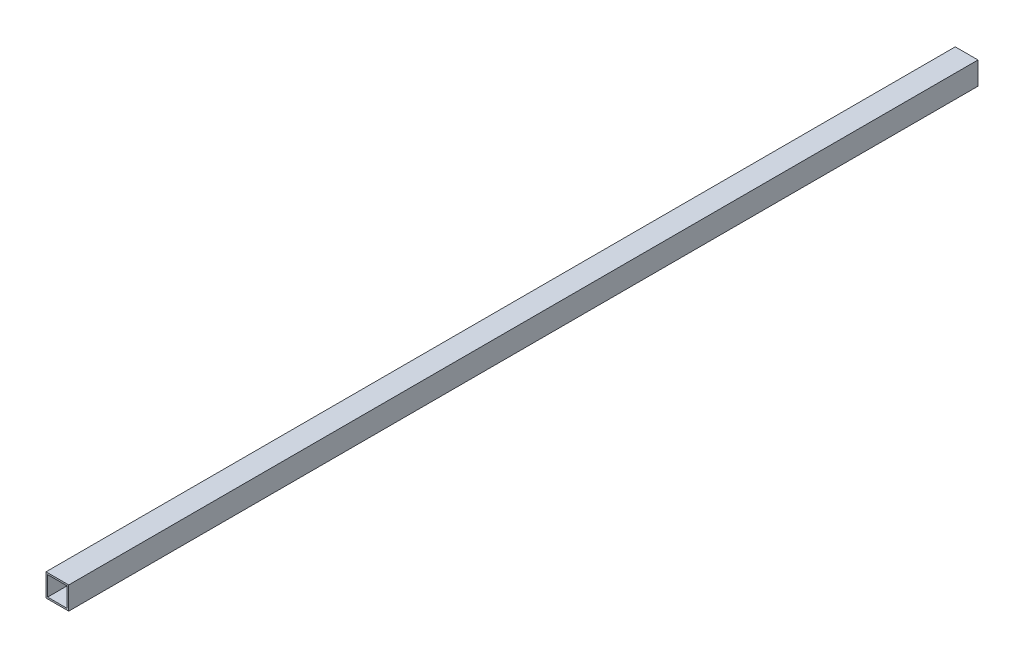
ISO-10303-21;
HEADER;
FILE_DESCRIPTION(('STEP AP214'),'2;1');
FILE_NAME('part.step','',(''),(''),'','','');
FILE_SCHEMA(('AUTOMOTIVE_DESIGN { 1 0 10303 214 1 1 1 1 }'));
ENDSEC;
DATA;
#1=APPLICATION_CONTEXT('core data for automotive mechanical design processes');
#2=APPLICATION_PROTOCOL_DEFINITION('international standard','automotive_design',2000,#1);
#3=PRODUCT_CONTEXT('',#1,'mechanical');
#4=PRODUCT('Part','Part','',(#3));
#5=PRODUCT_RELATED_PRODUCT_CATEGORY('part','',(#4));
#6=PRODUCT_DEFINITION_FORMATION('','',#4);
#7=PRODUCT_DEFINITION_CONTEXT('part definition',#1,'design');
#8=PRODUCT_DEFINITION('design','',#6,#7);
#9=PRODUCT_DEFINITION_SHAPE('','',#8);
#10=(LENGTH_UNIT() NAMED_UNIT(*) SI_UNIT(.MILLI.,.METRE.));
#11=(NAMED_UNIT(*) PLANE_ANGLE_UNIT() SI_UNIT($,.RADIAN.));
#12=(NAMED_UNIT(*) SI_UNIT($,.STERADIAN.) SOLID_ANGLE_UNIT());
#13=UNCERTAINTY_MEASURE_WITH_UNIT(LENGTH_MEASURE(1.E-05),#10,'distance_accuracy_value','');
#14=(GEOMETRIC_REPRESENTATION_CONTEXT(3) GLOBAL_UNCERTAINTY_ASSIGNED_CONTEXT((#13)) GLOBAL_UNIT_ASSIGNED_CONTEXT((#10,
#11,#12)) REPRESENTATION_CONTEXT('',''));
#15=CARTESIAN_POINT('',(0.,0.,0.));
#16=DIRECTION('',(0.,0.,1.));
#17=DIRECTION('',(1.,0.,0.));
#18=AXIS2_PLACEMENT_3D('',#15,#16,#17);
#19=CARTESIAN_POINT('',(0.,0.,1778.));
#20=DIRECTION('',(0.,0.,-1.));
#21=DIRECTION('',(-1.,0.,0.));
#22=AXIS2_PLACEMENT_3D('',#19,#20,#21);
#23=PLANE('',#22);
#24=DIRECTION('',(0.,-1.,0.));
#25=VECTOR('',#24,1.);
#26=CARTESIAN_POINT('',(0.,0.,1778.));
#27=LINE('',#26,#25);
#28=CARTESIAN_POINT('',(0.,44.45,1778.));
#29=VERTEX_POINT('',#28);
#30=CARTESIAN_POINT('',(0.,0.,1778.));
#31=VERTEX_POINT('',#30);
#32=EDGE_CURVE('E133',#29,#31,#27,.T.);
#33=ORIENTED_EDGE('',*,*,#32,.T.);
#34=DIRECTION('',(1.,0.,0.));
#35=VECTOR('',#34,1.);
#36=CARTESIAN_POINT('',(0.,0.,1778.));
#37=LINE('',#36,#35);
#38=CARTESIAN_POINT('',(44.45,0.,1778.));
#39=VERTEX_POINT('',#38);
#40=EDGE_CURVE('E136',#31,#39,#37,.T.);
#41=ORIENTED_EDGE('',*,*,#40,.T.);
#42=DIRECTION('',(0.,1.,0.));
#43=VECTOR('',#42,1.);
#44=CARTESIAN_POINT('',(44.45,0.,1778.));
#45=LINE('',#44,#43);
#46=CARTESIAN_POINT('',(44.45,44.45,1778.));
#47=VERTEX_POINT('',#46);
#48=EDGE_CURVE('E139',#39,#47,#45,.T.);
#49=ORIENTED_EDGE('',*,*,#48,.T.);
#50=DIRECTION('',(-1.,0.,0.));
#51=VECTOR('',#50,1.);
#52=CARTESIAN_POINT('',(0.,44.45,1778.));
#53=LINE('',#52,#51);
#54=EDGE_CURVE('E141',#47,#29,#53,.T.);
#55=ORIENTED_EDGE('',*,*,#54,.T.);
#56=EDGE_LOOP('',(#33,#41,#49,#55));
#57=FACE_BOUND('',#56,.T.);
#58=DIRECTION('',(0.,-1.,0.));
#59=VECTOR('',#58,1.);
#60=CARTESIAN_POINT('',(3.175,3.175,1778.));
#61=LINE('',#60,#59);
#62=CARTESIAN_POINT('',(3.175,41.275,1778.));
#63=VERTEX_POINT('',#62);
#64=CARTESIAN_POINT('',(3.175,3.175,1778.));
#65=VERTEX_POINT('',#64);
#66=EDGE_CURVE('E97',#63,#65,#61,.T.);
#67=ORIENTED_EDGE('',*,*,#66,.F.);
#68=DIRECTION('',(-1.,0.,0.));
#69=VECTOR('',#68,1.);
#70=CARTESIAN_POINT('',(3.175,41.275,1778.));
#71=LINE('',#70,#69);
#72=CARTESIAN_POINT('',(41.275,41.275,1778.));
#73=VERTEX_POINT('',#72);
#74=EDGE_CURVE('E119',#73,#63,#71,.T.);
#75=ORIENTED_EDGE('',*,*,#74,.F.);
#76=DIRECTION('',(0.,1.,0.));
#77=VECTOR('',#76,1.);
#78=CARTESIAN_POINT('',(41.275,3.175,1778.));
#79=LINE('',#78,#77);
#80=CARTESIAN_POINT('',(41.275,3.175,1778.));
#81=VERTEX_POINT('',#80);
#82=EDGE_CURVE('E117',#81,#73,#79,.T.);
#83=ORIENTED_EDGE('',*,*,#82,.F.);
#84=DIRECTION('',(1.,0.,0.));
#85=VECTOR('',#84,1.);
#86=CARTESIAN_POINT('',(3.175,3.175,1778.));
#87=LINE('',#86,#85);
#88=EDGE_CURVE('E105',#65,#81,#87,.T.);
#89=ORIENTED_EDGE('',*,*,#88,.F.);
#90=EDGE_LOOP('',(#67,#75,#83,#89));
#91=FACE_BOUND('',#90,.T.);
#92=ADVANCED_FACE('F32',(#57,#91),#23,.F.);
#93=CARTESIAN_POINT('',(0.,0.,0.));
#94=DIRECTION('',(0.,0.,-1.));
#95=DIRECTION('',(-1.,0.,0.));
#96=AXIS2_PLACEMENT_3D('',#93,#94,#95);
#97=PLANE('',#96);
#98=DIRECTION('',(0.,-1.,0.));
#99=VECTOR('',#98,1.);
#100=CARTESIAN_POINT('',(0.,0.,0.));
#101=LINE('',#100,#99);
#102=CARTESIAN_POINT('',(0.,44.45,0.));
#103=VERTEX_POINT('',#102);
#104=CARTESIAN_POINT('',(0.,0.,0.));
#105=VERTEX_POINT('',#104);
#106=EDGE_CURVE('E113',#103,#105,#101,.T.);
#107=ORIENTED_EDGE('',*,*,#106,.F.);
#108=DIRECTION('',(-1.,0.,0.));
#109=VECTOR('',#108,1.);
#110=CARTESIAN_POINT('',(0.,44.45,0.));
#111=LINE('',#110,#109);
#112=CARTESIAN_POINT('',(44.45,44.45,0.));
#113=VERTEX_POINT('',#112);
#114=EDGE_CURVE('E137',#113,#103,#111,.T.);
#115=ORIENTED_EDGE('',*,*,#114,.F.);
#116=DIRECTION('',(0.,1.,0.));
#117=VECTOR('',#116,1.);
#118=CARTESIAN_POINT('',(44.45,0.,0.));
#119=LINE('',#118,#117);
#120=CARTESIAN_POINT('',(44.45,0.,0.));
#121=VERTEX_POINT('',#120);
#122=EDGE_CURVE('E148',#121,#113,#119,.T.);
#123=ORIENTED_EDGE('',*,*,#122,.F.);
#124=DIRECTION('',(1.,0.,0.));
#125=VECTOR('',#124,1.);
#126=CARTESIAN_POINT('',(0.,0.,0.));
#127=LINE('',#126,#125);
#128=EDGE_CURVE('E146',#105,#121,#127,.T.);
#129=ORIENTED_EDGE('',*,*,#128,.F.);
#130=EDGE_LOOP('',(#107,#115,#123,#129));
#131=FACE_BOUND('',#130,.T.);
#132=DIRECTION('',(-1.,0.,0.));
#133=VECTOR('',#132,1.);
#134=CARTESIAN_POINT('',(3.175,41.275,0.));
#135=LINE('',#134,#133);
#136=CARTESIAN_POINT('',(41.275,41.275,0.));
#137=VERTEX_POINT('',#136);
#138=CARTESIAN_POINT('',(3.175,41.275,0.));
#139=VERTEX_POINT('',#138);
#140=EDGE_CURVE('E106',#137,#139,#135,.T.);
#141=ORIENTED_EDGE('',*,*,#140,.T.);
#142=DIRECTION('',(0.,-1.,0.));
#143=VECTOR('',#142,1.);
#144=CARTESIAN_POINT('',(3.175,3.175,0.));
#145=LINE('',#144,#143);
#146=CARTESIAN_POINT('',(3.175,3.175,0.));
#147=VERTEX_POINT('',#146);
#148=EDGE_CURVE('E55',#139,#147,#145,.T.);
#149=ORIENTED_EDGE('',*,*,#148,.T.);
#150=DIRECTION('',(1.,0.,0.));
#151=VECTOR('',#150,1.);
#152=CARTESIAN_POINT('',(3.175,3.175,0.));
#153=LINE('',#152,#151);
#154=CARTESIAN_POINT('',(41.275,3.175,0.));
#155=VERTEX_POINT('',#154);
#156=EDGE_CURVE('E112',#147,#155,#153,.T.);
#157=ORIENTED_EDGE('',*,*,#156,.T.);
#158=DIRECTION('',(0.,1.,0.));
#159=VECTOR('',#158,1.);
#160=CARTESIAN_POINT('',(41.275,3.175,0.));
#161=LINE('',#160,#159);
#162=EDGE_CURVE('E125',#155,#137,#161,.T.);
#163=ORIENTED_EDGE('',*,*,#162,.T.);
#164=EDGE_LOOP('',(#141,#149,#157,#163));
#165=FACE_BOUND('',#164,.T.);
#166=ADVANCED_FACE('F166',(#131,#165),#97,.T.);
#167=CARTESIAN_POINT('',(0.,0.,1778.));
#168=DIRECTION('',(1.,0.,0.));
#169=DIRECTION('',(0.,0.,-1.));
#170=AXIS2_PLACEMENT_3D('',#167,#168,#169);
#171=PLANE('',#170);
#172=ORIENTED_EDGE('',*,*,#106,.T.);
#173=DIRECTION('',(0.,0.,-1.));
#174=VECTOR('',#173,1.);
#175=CARTESIAN_POINT('',(0.,0.,1778.));
#176=LINE('',#175,#174);
#177=EDGE_CURVE('E11',#31,#105,#176,.T.);
#178=ORIENTED_EDGE('',*,*,#177,.F.);
#179=ORIENTED_EDGE('',*,*,#32,.F.);
#180=DIRECTION('',(0.,0.,-1.));
#181=VECTOR('',#180,1.);
#182=CARTESIAN_POINT('',(0.,44.45,1778.));
#183=LINE('',#182,#181);
#184=EDGE_CURVE('E143',#29,#103,#183,.T.);
#185=ORIENTED_EDGE('',*,*,#184,.T.);
#186=EDGE_LOOP('',(#172,#178,#179,#185));
#187=FACE_BOUND('',#186,.T.);
#188=ADVANCED_FACE('F34',(#187),#171,.F.);
#189=CARTESIAN_POINT('',(0.,0.,1778.));
#190=DIRECTION('',(0.,1.,0.));
#191=DIRECTION('',(0.,0.,1.));
#192=AXIS2_PLACEMENT_3D('',#189,#190,#191);
#193=PLANE('',#192);
#194=ORIENTED_EDGE('',*,*,#128,.T.);
#195=DIRECTION('',(0.,0.,-1.));
#196=VECTOR('',#195,1.);
#197=CARTESIAN_POINT('',(44.45,0.,1778.));
#198=LINE('',#197,#196);
#199=EDGE_CURVE('E40',#39,#121,#198,.T.);
#200=ORIENTED_EDGE('',*,*,#199,.F.);
#201=ORIENTED_EDGE('',*,*,#40,.F.);
#202=ORIENTED_EDGE('',*,*,#177,.T.);
#203=EDGE_LOOP('',(#194,#200,#201,#202));
#204=FACE_BOUND('',#203,.T.);
#205=ADVANCED_FACE('F176',(#204),#193,.F.);
#206=CARTESIAN_POINT('',(44.45,0.,1778.));
#207=DIRECTION('',(-1.,0.,0.));
#208=DIRECTION('',(0.,0.,1.));
#209=AXIS2_PLACEMENT_3D('',#206,#207,#208);
#210=PLANE('',#209);
#211=ORIENTED_EDGE('',*,*,#122,.T.);
#212=DIRECTION('',(0.,0.,-1.));
#213=VECTOR('',#212,1.);
#214=CARTESIAN_POINT('',(44.45,44.45,1778.));
#215=LINE('',#214,#213);
#216=EDGE_CURVE('E153',#47,#113,#215,.T.);
#217=ORIENTED_EDGE('',*,*,#216,.F.);
#218=ORIENTED_EDGE('',*,*,#48,.F.);
#219=ORIENTED_EDGE('',*,*,#199,.T.);
#220=EDGE_LOOP('',(#211,#217,#218,#219));
#221=FACE_BOUND('',#220,.T.);
#222=ADVANCED_FACE('F160',(#221),#210,.F.);
#223=CARTESIAN_POINT('',(0.,44.45,1778.));
#224=DIRECTION('',(0.,-1.,0.));
#225=DIRECTION('',(0.,0.,-1.));
#226=AXIS2_PLACEMENT_3D('',#223,#224,#225);
#227=PLANE('',#226);
#228=ORIENTED_EDGE('',*,*,#114,.T.);
#229=ORIENTED_EDGE('',*,*,#184,.F.);
#230=ORIENTED_EDGE('',*,*,#54,.F.);
#231=ORIENTED_EDGE('',*,*,#216,.T.);
#232=EDGE_LOOP('',(#228,#229,#230,#231));
#233=FACE_BOUND('',#232,.T.);
#234=ADVANCED_FACE('F170',(#233),#227,.F.);
#235=CARTESIAN_POINT('',(3.175,3.175,1778.));
#236=DIRECTION('',(1.,0.,0.));
#237=DIRECTION('',(0.,0.,-1.));
#238=AXIS2_PLACEMENT_3D('',#235,#236,#237);
#239=PLANE('',#238);
#240=ORIENTED_EDGE('',*,*,#148,.F.);
#241=DIRECTION('',(0.,0.,-1.));
#242=VECTOR('',#241,1.);
#243=CARTESIAN_POINT('',(3.175,41.275,1778.));
#244=LINE('',#243,#242);
#245=EDGE_CURVE('E101',#63,#139,#244,.T.);
#246=ORIENTED_EDGE('',*,*,#245,.F.);
#247=ORIENTED_EDGE('',*,*,#66,.T.);
#248=DIRECTION('',(0.,0.,-1.));
#249=VECTOR('',#248,1.);
#250=CARTESIAN_POINT('',(3.175,3.175,1778.));
#251=LINE('',#250,#249);
#252=EDGE_CURVE('E100',#65,#147,#251,.T.);
#253=ORIENTED_EDGE('',*,*,#252,.T.);
#254=EDGE_LOOP('',(#240,#246,#247,#253));
#255=FACE_BOUND('',#254,.T.);
#256=ADVANCED_FACE('F99',(#255),#239,.T.);
#257=CARTESIAN_POINT('',(3.175,3.175,1778.));
#258=DIRECTION('',(0.,1.,0.));
#259=DIRECTION('',(0.,0.,1.));
#260=AXIS2_PLACEMENT_3D('',#257,#258,#259);
#261=PLANE('',#260);
#262=ORIENTED_EDGE('',*,*,#156,.F.);
#263=ORIENTED_EDGE('',*,*,#252,.F.);
#264=ORIENTED_EDGE('',*,*,#88,.T.);
#265=DIRECTION('',(0.,0.,-1.));
#266=VECTOR('',#265,1.);
#267=CARTESIAN_POINT('',(41.275,3.175,1778.));
#268=LINE('',#267,#266);
#269=EDGE_CURVE('E114',#81,#155,#268,.T.);
#270=ORIENTED_EDGE('',*,*,#269,.T.);
#271=EDGE_LOOP('',(#262,#263,#264,#270));
#272=FACE_BOUND('',#271,.T.);
#273=ADVANCED_FACE('F109',(#272),#261,.T.);
#274=CARTESIAN_POINT('',(41.275,3.175,1778.));
#275=DIRECTION('',(-1.,0.,0.));
#276=DIRECTION('',(0.,0.,1.));
#277=AXIS2_PLACEMENT_3D('',#274,#275,#276);
#278=PLANE('',#277);
#279=ORIENTED_EDGE('',*,*,#162,.F.);
#280=ORIENTED_EDGE('',*,*,#269,.F.);
#281=ORIENTED_EDGE('',*,*,#82,.T.);
#282=DIRECTION('',(0.,0.,-1.));
#283=VECTOR('',#282,1.);
#284=CARTESIAN_POINT('',(41.275,41.275,1778.));
#285=LINE('',#284,#283);
#286=EDGE_CURVE('E47',#73,#137,#285,.T.);
#287=ORIENTED_EDGE('',*,*,#286,.T.);
#288=EDGE_LOOP('',(#279,#280,#281,#287));
#289=FACE_BOUND('',#288,.T.);
#290=ADVANCED_FACE('F199',(#289),#278,.T.);
#291=CARTESIAN_POINT('',(3.175,41.275,1778.));
#292=DIRECTION('',(0.,-1.,0.));
#293=DIRECTION('',(0.,0.,-1.));
#294=AXIS2_PLACEMENT_3D('',#291,#292,#293);
#295=PLANE('',#294);
#296=ORIENTED_EDGE('',*,*,#140,.F.);
#297=ORIENTED_EDGE('',*,*,#286,.F.);
#298=ORIENTED_EDGE('',*,*,#74,.T.);
#299=ORIENTED_EDGE('',*,*,#245,.T.);
#300=EDGE_LOOP('',(#296,#297,#298,#299));
#301=FACE_BOUND('',#300,.T.);
#302=ADVANCED_FACE('F203',(#301),#295,.T.);
#303=CLOSED_SHELL('',(#92,#166,#188,#205,#222,#234,#256,#273,#290,#302));
#304=MANIFOLD_SOLID_BREP('B2',#303);
#305=ADVANCED_BREP_SHAPE_REPRESENTATION('',(#18,#304),#14);
#306=SHAPE_DEFINITION_REPRESENTATION(#9,#305);
ENDSEC;
END-ISO-10303-21;
